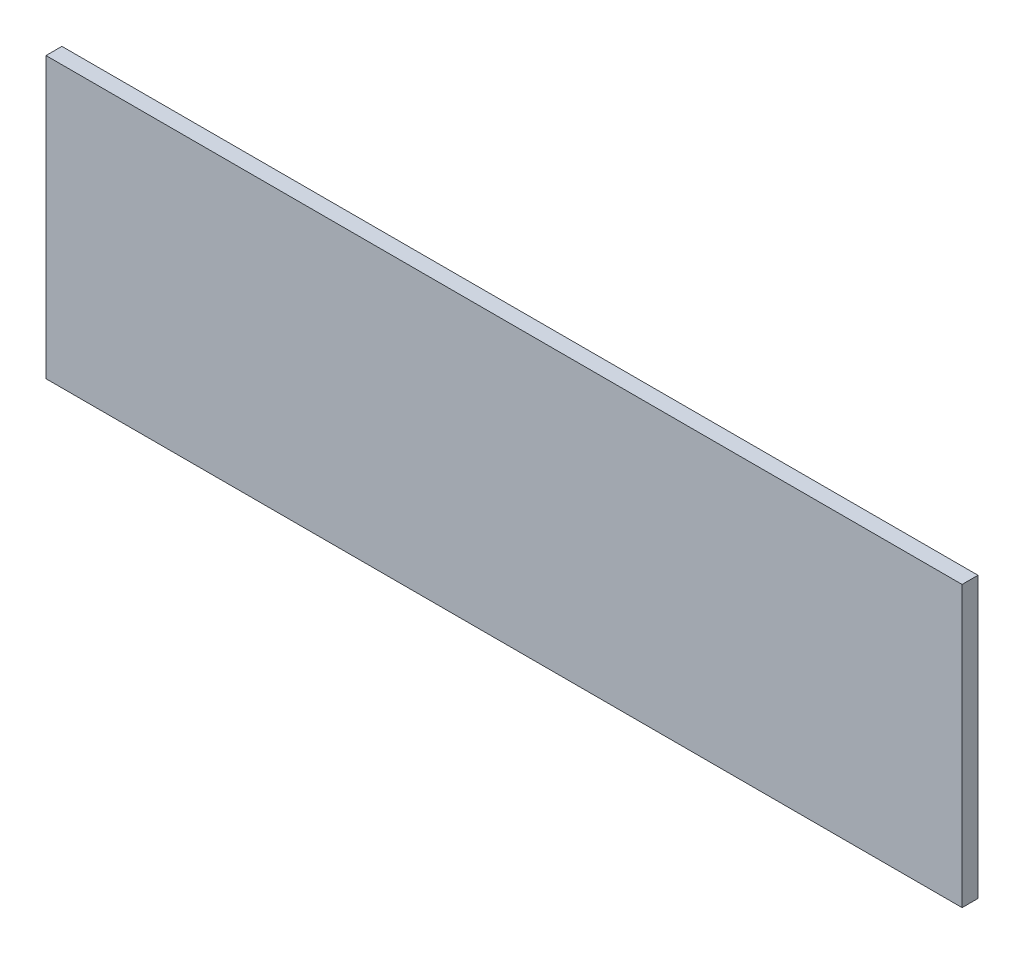
ISO-10303-21;
HEADER;
FILE_DESCRIPTION(('STEP AP214'),'2;1');
FILE_NAME('part.step','',(''),(''),'','','');
FILE_SCHEMA(('AUTOMOTIVE_DESIGN { 1 0 10303 214 1 1 1 1 }'));
ENDSEC;
DATA;
#1=APPLICATION_CONTEXT('core data for automotive mechanical design processes');
#2=APPLICATION_PROTOCOL_DEFINITION('international standard','automotive_design',2000,#1);
#3=PRODUCT_CONTEXT('',#1,'mechanical');
#4=PRODUCT('Part','Part','',(#3));
#5=PRODUCT_RELATED_PRODUCT_CATEGORY('part','',(#4));
#6=PRODUCT_DEFINITION_FORMATION('','',#4);
#7=PRODUCT_DEFINITION_CONTEXT('part definition',#1,'design');
#8=PRODUCT_DEFINITION('design','',#6,#7);
#9=PRODUCT_DEFINITION_SHAPE('','',#8);
#10=(LENGTH_UNIT() NAMED_UNIT(*) SI_UNIT(.MILLI.,.METRE.));
#11=(NAMED_UNIT(*) PLANE_ANGLE_UNIT() SI_UNIT($,.RADIAN.));
#12=(NAMED_UNIT(*) SI_UNIT($,.STERADIAN.) SOLID_ANGLE_UNIT());
#13=UNCERTAINTY_MEASURE_WITH_UNIT(LENGTH_MEASURE(1.E-05),#10,'distance_accuracy_value','');
#14=(GEOMETRIC_REPRESENTATION_CONTEXT(3) GLOBAL_UNCERTAINTY_ASSIGNED_CONTEXT((#13)) GLOBAL_UNIT_ASSIGNED_CONTEXT((#10,
#11,#12)) REPRESENTATION_CONTEXT('',''));
#15=CARTESIAN_POINT('',(0.,0.,0.));
#16=DIRECTION('',(0.,0.,1.));
#17=DIRECTION('',(1.,0.,0.));
#18=AXIS2_PLACEMENT_3D('',#15,#16,#17);
#19=CARTESIAN_POINT('',(360.,110.,12.5));
#20=DIRECTION('',(-1.,0.,0.));
#21=DIRECTION('',(0.,-1.,0.));
#22=AXIS2_PLACEMENT_3D('',#19,#20,#21);
#23=PLANE('',#22);
#24=DIRECTION('',(0.,1.,0.));
#25=VECTOR('',#24,1.);
#26=CARTESIAN_POINT('',(360.,110.,0.));
#27=LINE('',#26,#25);
#28=CARTESIAN_POINT('',(360.,-110.,0.));
#29=VERTEX_POINT('',#28);
#30=CARTESIAN_POINT('',(360.,110.,0.));
#31=VERTEX_POINT('',#30);
#32=EDGE_CURVE('E98',#29,#31,#27,.T.);
#33=ORIENTED_EDGE('',*,*,#32,.T.);
#34=DIRECTION('',(0.,0.,-1.));
#35=VECTOR('',#34,1.);
#36=CARTESIAN_POINT('',(360.,110.,12.5));
#37=LINE('',#36,#35);
#38=CARTESIAN_POINT('',(360.,110.,12.5));
#39=VERTEX_POINT('',#38);
#40=EDGE_CURVE('E11',#39,#31,#37,.T.);
#41=ORIENTED_EDGE('',*,*,#40,.F.);
#42=DIRECTION('',(0.,1.,0.));
#43=VECTOR('',#42,1.);
#44=CARTESIAN_POINT('',(360.,110.,12.5));
#45=LINE('',#44,#43);
#46=CARTESIAN_POINT('',(360.,-110.,12.5));
#47=VERTEX_POINT('',#46);
#48=EDGE_CURVE('E86',#47,#39,#45,.T.);
#49=ORIENTED_EDGE('',*,*,#48,.F.);
#50=DIRECTION('',(0.,0.,-1.));
#51=VECTOR('',#50,1.);
#52=CARTESIAN_POINT('',(360.,-110.,12.5));
#53=LINE('',#52,#51);
#54=EDGE_CURVE('E94',#47,#29,#53,.T.);
#55=ORIENTED_EDGE('',*,*,#54,.T.);
#56=EDGE_LOOP('',(#33,#41,#49,#55));
#57=FACE_BOUND('',#56,.T.);
#58=ADVANCED_FACE('F35',(#57),#23,.F.);
#59=CARTESIAN_POINT('',(-360.,110.,12.5));
#60=DIRECTION('',(0.,-1.,0.));
#61=DIRECTION('',(0.,0.,-1.));
#62=AXIS2_PLACEMENT_3D('',#59,#60,#61);
#63=PLANE('',#62);
#64=DIRECTION('',(-1.,0.,0.));
#65=VECTOR('',#64,1.);
#66=CARTESIAN_POINT('',(-360.,110.,0.));
#67=LINE('',#66,#65);
#68=CARTESIAN_POINT('',(-360.,110.,0.));
#69=VERTEX_POINT('',#68);
#70=EDGE_CURVE('E90',#31,#69,#67,.T.);
#71=ORIENTED_EDGE('',*,*,#70,.T.);
#72=DIRECTION('',(0.,0.,-1.));
#73=VECTOR('',#72,1.);
#74=CARTESIAN_POINT('',(-360.,110.,12.5));
#75=LINE('',#74,#73);
#76=CARTESIAN_POINT('',(-360.,110.,12.5));
#77=VERTEX_POINT('',#76);
#78=EDGE_CURVE('E43',#77,#69,#75,.T.);
#79=ORIENTED_EDGE('',*,*,#78,.F.);
#80=DIRECTION('',(-1.,0.,0.));
#81=VECTOR('',#80,1.);
#82=CARTESIAN_POINT('',(-360.,110.,12.5));
#83=LINE('',#82,#81);
#84=EDGE_CURVE('E81',#39,#77,#83,.T.);
#85=ORIENTED_EDGE('',*,*,#84,.F.);
#86=ORIENTED_EDGE('',*,*,#40,.T.);
#87=EDGE_LOOP('',(#71,#79,#85,#86));
#88=FACE_BOUND('',#87,.T.);
#89=ADVANCED_FACE('F89',(#88),#63,.F.);
#90=CARTESIAN_POINT('',(-360.,110.,12.5));
#91=DIRECTION('',(1.,0.,0.));
#92=DIRECTION('',(0.,1.,0.));
#93=AXIS2_PLACEMENT_3D('',#90,#91,#92);
#94=PLANE('',#93);
#95=DIRECTION('',(0.,-1.,0.));
#96=VECTOR('',#95,1.);
#97=CARTESIAN_POINT('',(-360.,110.,0.));
#98=LINE('',#97,#96);
#99=CARTESIAN_POINT('',(-360.,-110.,0.));
#100=VERTEX_POINT('',#99);
#101=EDGE_CURVE('E68',#69,#100,#98,.T.);
#102=ORIENTED_EDGE('',*,*,#101,.T.);
#103=DIRECTION('',(0.,0.,-1.));
#104=VECTOR('',#103,1.);
#105=CARTESIAN_POINT('',(-360.,-110.,12.5));
#106=LINE('',#105,#104);
#107=CARTESIAN_POINT('',(-360.,-110.,12.5));
#108=VERTEX_POINT('',#107);
#109=EDGE_CURVE('E91',#108,#100,#106,.T.);
#110=ORIENTED_EDGE('',*,*,#109,.F.);
#111=DIRECTION('',(0.,-1.,0.));
#112=VECTOR('',#111,1.);
#113=CARTESIAN_POINT('',(-360.,110.,12.5));
#114=LINE('',#113,#112);
#115=EDGE_CURVE('E84',#77,#108,#114,.T.);
#116=ORIENTED_EDGE('',*,*,#115,.F.);
#117=ORIENTED_EDGE('',*,*,#78,.T.);
#118=EDGE_LOOP('',(#102,#110,#116,#117));
#119=FACE_BOUND('',#118,.T.);
#120=ADVANCED_FACE('F92',(#119),#94,.F.);
#121=CARTESIAN_POINT('',(-360.,-110.,12.5));
#122=DIRECTION('',(0.,1.,0.));
#123=DIRECTION('',(-1.,0.,0.));
#124=AXIS2_PLACEMENT_3D('',#121,#122,#123);
#125=PLANE('',#124);
#126=DIRECTION('',(1.,0.,0.));
#127=VECTOR('',#126,1.);
#128=CARTESIAN_POINT('',(-360.,-110.,0.));
#129=LINE('',#128,#127);
#130=EDGE_CURVE('E74',#100,#29,#129,.T.);
#131=ORIENTED_EDGE('',*,*,#130,.T.);
#132=ORIENTED_EDGE('',*,*,#54,.F.);
#133=DIRECTION('',(1.,0.,0.));
#134=VECTOR('',#133,1.);
#135=CARTESIAN_POINT('',(-360.,-110.,12.5));
#136=LINE('',#135,#134);
#137=EDGE_CURVE('E51',#108,#47,#136,.T.);
#138=ORIENTED_EDGE('',*,*,#137,.F.);
#139=ORIENTED_EDGE('',*,*,#109,.T.);
#140=EDGE_LOOP('',(#131,#132,#138,#139));
#141=FACE_BOUND('',#140,.T.);
#142=ADVANCED_FACE('F105',(#141),#125,.F.);
#143=CARTESIAN_POINT('',(0.,0.,12.5));
#144=DIRECTION('',(0.,0.,1.));
#145=DIRECTION('',(1.,0.,0.));
#146=AXIS2_PLACEMENT_3D('',#143,#144,#145);
#147=PLANE('',#146);
#148=ORIENTED_EDGE('',*,*,#48,.T.);
#149=ORIENTED_EDGE('',*,*,#84,.T.);
#150=ORIENTED_EDGE('',*,*,#115,.T.);
#151=ORIENTED_EDGE('',*,*,#137,.T.);
#152=EDGE_LOOP('',(#148,#149,#150,#151));
#153=FACE_BOUND('',#152,.T.);
#154=ADVANCED_FACE('F82',(#153),#147,.T.);
#155=CARTESIAN_POINT('',(0.,0.,0.));
#156=DIRECTION('',(0.,0.,1.));
#157=DIRECTION('',(1.,0.,0.));
#158=AXIS2_PLACEMENT_3D('',#155,#156,#157);
#159=PLANE('',#158);
#160=ORIENTED_EDGE('',*,*,#32,.F.);
#161=ORIENTED_EDGE('',*,*,#130,.F.);
#162=ORIENTED_EDGE('',*,*,#101,.F.);
#163=ORIENTED_EDGE('',*,*,#70,.F.);
#164=EDGE_LOOP('',(#160,#161,#162,#163));
#165=FACE_BOUND('',#164,.T.);
#166=ADVANCED_FACE('F108',(#165),#159,.F.);
#167=CLOSED_SHELL('',(#58,#89,#120,#142,#154,#166));
#168=MANIFOLD_SOLID_BREP('B2',#167);
#169=ADVANCED_BREP_SHAPE_REPRESENTATION('',(#18,#168),#14);
#170=SHAPE_DEFINITION_REPRESENTATION(#9,#169);
ENDSEC;
END-ISO-10303-21;
